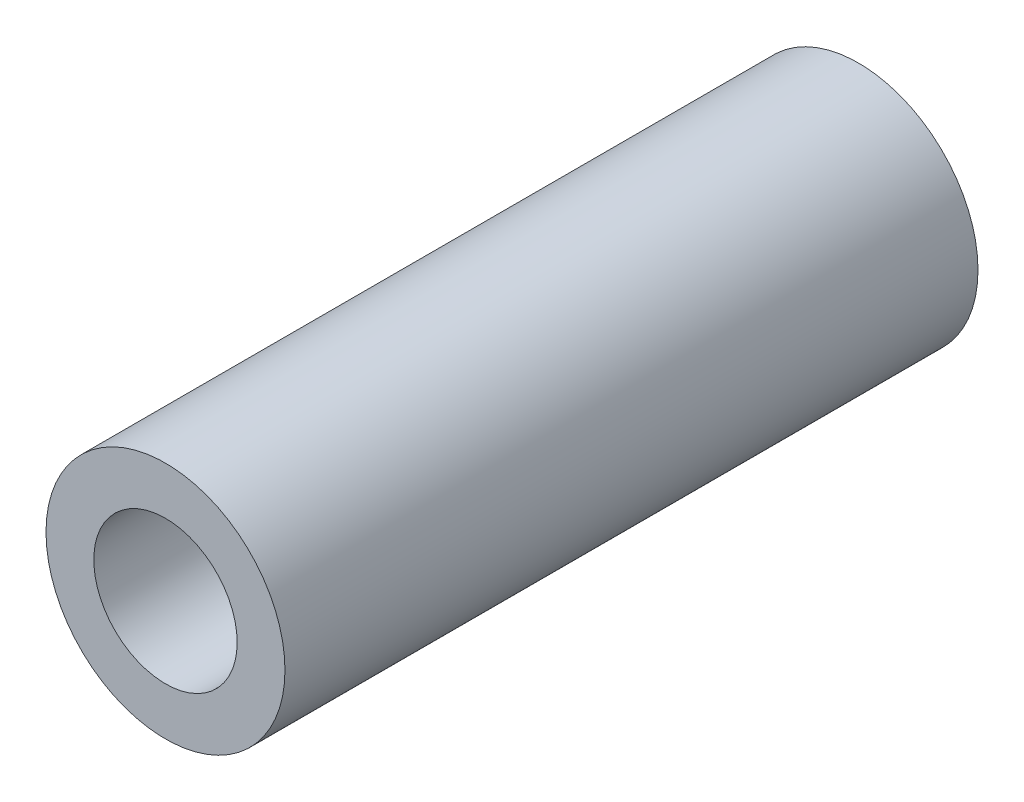
ISO-10303-21;
HEADER;
FILE_DESCRIPTION(('STEP AP214'),'2;1');
FILE_NAME('part.step','',(''),(''),'','','');
FILE_SCHEMA(('AUTOMOTIVE_DESIGN { 1 0 10303 214 1 1 1 1 }'));
ENDSEC;
DATA;
#1=APPLICATION_CONTEXT('core data for automotive mechanical design processes');
#2=APPLICATION_PROTOCOL_DEFINITION('international standard','automotive_design',2000,#1);
#3=PRODUCT_CONTEXT('',#1,'mechanical');
#4=PRODUCT('Part','Part','',(#3));
#5=PRODUCT_RELATED_PRODUCT_CATEGORY('part','',(#4));
#6=PRODUCT_DEFINITION_FORMATION('','',#4);
#7=PRODUCT_DEFINITION_CONTEXT('part definition',#1,'design');
#8=PRODUCT_DEFINITION('design','',#6,#7);
#9=PRODUCT_DEFINITION_SHAPE('','',#8);
#10=(LENGTH_UNIT() NAMED_UNIT(*) SI_UNIT(.MILLI.,.METRE.));
#11=(NAMED_UNIT(*) PLANE_ANGLE_UNIT() SI_UNIT($,.RADIAN.));
#12=(NAMED_UNIT(*) SI_UNIT($,.STERADIAN.) SOLID_ANGLE_UNIT());
#13=UNCERTAINTY_MEASURE_WITH_UNIT(LENGTH_MEASURE(1.E-05),#10,'distance_accuracy_value','');
#14=(GEOMETRIC_REPRESENTATION_CONTEXT(3) GLOBAL_UNCERTAINTY_ASSIGNED_CONTEXT((#13)) GLOBAL_UNIT_ASSIGNED_CONTEXT((#10,
#11,#12)) REPRESENTATION_CONTEXT('',''));
#15=CARTESIAN_POINT('',(0.,0.,0.));
#16=DIRECTION('',(0.,0.,1.));
#17=DIRECTION('',(1.,0.,0.));
#18=AXIS2_PLACEMENT_3D('',#15,#16,#17);
#19=CARTESIAN_POINT('',(0.,0.,14.5));
#20=DIRECTION('',(0.,0.,1.));
#21=DIRECTION('',(1.,0.,0.));
#22=AXIS2_PLACEMENT_3D('',#19,#20,#21);
#23=PLANE('',#22);
#24=CARTESIAN_POINT('',(0.,0.,14.5));
#25=DIRECTION('',(0.,0.,1.));
#26=DIRECTION('',(1.,0.,0.));
#27=AXIS2_PLACEMENT_3D('',#24,#25,#26);
#28=CIRCLE('',#27,2.5);
#29=CARTESIAN_POINT('',(2.5,0.,14.5));
#30=VERTEX_POINT('',#29);
#31=EDGE_CURVE('E10',#30,#30,#28,.T.);
#32=ORIENTED_EDGE('',*,*,#31,.T.);
#33=EDGE_LOOP('',(#32));
#34=FACE_BOUND('',#33,.T.);
#35=CARTESIAN_POINT('',(0.,0.,14.5));
#36=DIRECTION('',(0.,0.,1.));
#37=DIRECTION('',(1.,0.,0.));
#38=AXIS2_PLACEMENT_3D('',#35,#36,#37);
#39=CIRCLE('',#38,1.5);
#40=CARTESIAN_POINT('',(1.5,0.,14.5));
#41=VERTEX_POINT('',#40);
#42=EDGE_CURVE('E47',#41,#41,#39,.T.);
#43=ORIENTED_EDGE('',*,*,#42,.F.);
#44=EDGE_LOOP('',(#43));
#45=FACE_BOUND('',#44,.T.);
#46=ADVANCED_FACE('F36',(#34,#45),#23,.T.);
#47=CARTESIAN_POINT('',(0.,0.,0.));
#48=DIRECTION('',(0.,0.,1.));
#49=DIRECTION('',(1.,0.,0.));
#50=AXIS2_PLACEMENT_3D('',#47,#48,#49);
#51=PLANE('',#50);
#52=CARTESIAN_POINT('',(0.,0.,0.));
#53=DIRECTION('',(0.,0.,1.));
#54=DIRECTION('',(1.,0.,0.));
#55=AXIS2_PLACEMENT_3D('',#52,#53,#54);
#56=CIRCLE('',#55,2.5);
#57=CARTESIAN_POINT('',(2.5,0.,0.));
#58=VERTEX_POINT('',#57);
#59=EDGE_CURVE('E40',#58,#58,#56,.T.);
#60=ORIENTED_EDGE('',*,*,#59,.F.);
#61=EDGE_LOOP('',(#60));
#62=FACE_BOUND('',#61,.T.);
#63=CARTESIAN_POINT('',(0.,0.,0.));
#64=DIRECTION('',(0.,0.,1.));
#65=DIRECTION('',(1.,0.,0.));
#66=AXIS2_PLACEMENT_3D('',#63,#64,#65);
#67=CIRCLE('',#66,1.5);
#68=CARTESIAN_POINT('',(1.5,0.,0.));
#69=VERTEX_POINT('',#68);
#70=EDGE_CURVE('E49',#69,#69,#67,.T.);
#71=ORIENTED_EDGE('',*,*,#70,.T.);
#72=EDGE_LOOP('',(#71));
#73=FACE_BOUND('',#72,.T.);
#74=ADVANCED_FACE('F59',(#62,#73),#51,.F.);
#75=CARTESIAN_POINT('',(0.,0.,14.5));
#76=DIRECTION('',(0.,0.,-1.));
#77=DIRECTION('',(-1.,0.,0.));
#78=AXIS2_PLACEMENT_3D('',#75,#76,#77);
#79=CYLINDRICAL_SURFACE('',#78,2.5);
#80=ORIENTED_EDGE('',*,*,#31,.F.);
#81=EDGE_LOOP('',(#80));
#82=FACE_BOUND('',#81,.T.);
#83=ORIENTED_EDGE('',*,*,#59,.T.);
#84=EDGE_LOOP('',(#83));
#85=FACE_BOUND('',#84,.T.);
#86=ADVANCED_FACE('F38',(#82,#85),#79,.T.);
#87=CARTESIAN_POINT('',(0.,0.,14.5));
#88=DIRECTION('',(0.,0.,-1.));
#89=DIRECTION('',(-1.,0.,0.));
#90=AXIS2_PLACEMENT_3D('',#87,#88,#89);
#91=CYLINDRICAL_SURFACE('',#90,1.5);
#92=ORIENTED_EDGE('',*,*,#42,.T.);
#93=EDGE_LOOP('',(#92));
#94=FACE_BOUND('',#93,.T.);
#95=ORIENTED_EDGE('',*,*,#70,.F.);
#96=EDGE_LOOP('',(#95));
#97=FACE_BOUND('',#96,.T.);
#98=ADVANCED_FACE('F55',(#94,#97),#91,.F.);
#99=CLOSED_SHELL('',(#46,#74,#86,#98));
#100=MANIFOLD_SOLID_BREP('B2',#99);
#101=ADVANCED_BREP_SHAPE_REPRESENTATION('',(#18,#100),#14);
#102=SHAPE_DEFINITION_REPRESENTATION(#9,#101);
ENDSEC;
END-ISO-10303-21;
